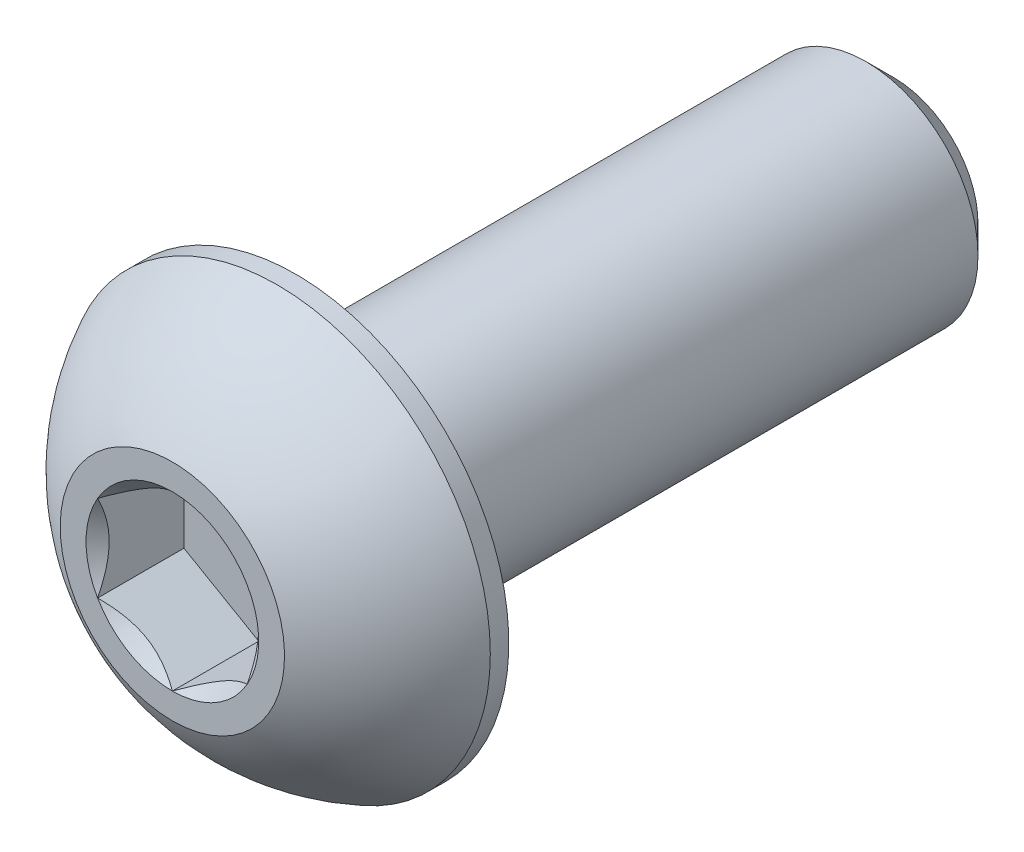
ISO-10303-21;
HEADER;
FILE_DESCRIPTION(('STEP AP214'),'2;1');
FILE_NAME('part.step','',(''),(''),'','','');
FILE_SCHEMA(('AUTOMOTIVE_DESIGN { 1 0 10303 214 1 1 1 1 }'));
ENDSEC;
DATA;
#1=APPLICATION_CONTEXT('core data for automotive mechanical design processes');
#2=APPLICATION_PROTOCOL_DEFINITION('international standard','automotive_design',2000,#1);
#3=PRODUCT_CONTEXT('',#1,'mechanical');
#4=PRODUCT('Part','Part','',(#3));
#5=PRODUCT_RELATED_PRODUCT_CATEGORY('part','',(#4));
#6=PRODUCT_DEFINITION_FORMATION('','',#4);
#7=PRODUCT_DEFINITION_CONTEXT('part definition',#1,'design');
#8=PRODUCT_DEFINITION('design','',#6,#7);
#9=PRODUCT_DEFINITION_SHAPE('','',#8);
#10=(LENGTH_UNIT() NAMED_UNIT(*) SI_UNIT(.MILLI.,.METRE.));
#11=(NAMED_UNIT(*) PLANE_ANGLE_UNIT() SI_UNIT($,.RADIAN.));
#12=(NAMED_UNIT(*) SI_UNIT($,.STERADIAN.) SOLID_ANGLE_UNIT());
#13=UNCERTAINTY_MEASURE_WITH_UNIT(LENGTH_MEASURE(1.E-05),#10,'distance_accuracy_value','');
#14=(GEOMETRIC_REPRESENTATION_CONTEXT(3) GLOBAL_UNCERTAINTY_ASSIGNED_CONTEXT((#13)) GLOBAL_UNIT_ASSIGNED_CONTEXT((#10,
#11,#12)) REPRESENTATION_CONTEXT('',''));
#15=CARTESIAN_POINT('',(0.,0.,0.));
#16=DIRECTION('',(0.,0.,1.));
#17=DIRECTION('',(1.,0.,0.));
#18=AXIS2_PLACEMENT_3D('',#15,#16,#17);
#19=CARTESIAN_POINT('',(0.,-1.15470053837925,-1.155));
#20=DIRECTION('',(0.5,-0.866025403784439,0.));
#21=DIRECTION('',(0.,0.,-1.));
#22=AXIS2_PLACEMENT_3D('',#19,#20,#21);
#23=PLANE('',#22);
#24=DIRECTION('',(0.,0.,1.));
#25=VECTOR('',#24,1.);
#26=CARTESIAN_POINT('',(0.,-1.15470053837925,-1.155));
#27=LINE('',#26,#25);
#28=CARTESIAN_POINT('',(0.,-1.15470053837925,-1.155));
#29=VERTEX_POINT('',#28);
#30=CARTESIAN_POINT('',(0.,-1.15470053837925,0.));
#31=VERTEX_POINT('',#30);
#32=EDGE_CURVE('E11',#29,#31,#27,.T.);
#33=ORIENTED_EDGE('',*,*,#32,.T.);
#34=CARTESIAN_POINT('',(0.,-1.15470053837922,0.));
#35=CARTESIAN_POINT('',(0.5,-0.866025403784439,-0.288675134594791));
#36=CARTESIAN_POINT('',(0.999999999999949,-0.577350269189654,0.));
#37=(BOUNDED_CURVE() B_SPLINE_CURVE(2,(#34,#35,#36),.UNSPECIFIED.,.F.,
.F.) B_SPLINE_CURVE_WITH_KNOTS((3,3),(-0.3218671551163,-0.124274873543865),
.UNSPECIFIED.) CURVE() GEOMETRIC_REPRESENTATION_ITEM() RATIONAL_B_SPLINE_CURVE((1.46410161513778,
1.69059892324148,1.46410161513778)) REPRESENTATION_ITEM(''));
#38=CARTESIAN_POINT('',(1.,-0.577350269189625,0.));
#39=VERTEX_POINT('',#38);
#40=EDGE_CURVE('E115',#31,#39,#37,.T.);
#41=ORIENTED_EDGE('',*,*,#40,.T.);
#42=DIRECTION('',(0.,0.,1.));
#43=VECTOR('',#42,1.);
#44=CARTESIAN_POINT('',(1.,-0.577350269189625,-1.155));
#45=LINE('',#44,#43);
#46=CARTESIAN_POINT('',(1.,-0.577350269189625,-1.155));
#47=VERTEX_POINT('',#46);
#48=EDGE_CURVE('E250',#47,#39,#45,.T.);
#49=ORIENTED_EDGE('',*,*,#48,.F.);
#50=DIRECTION('',(0.866025403784439,0.5,0.));
#51=VECTOR('',#50,1.);
#52=CARTESIAN_POINT('',(0.,-1.15470053837925,-1.155));
#53=LINE('',#52,#51);
#54=EDGE_CURVE('E118',#29,#47,#53,.T.);
#55=ORIENTED_EDGE('',*,*,#54,.F.);
#56=EDGE_LOOP('',(#33,#41,#49,#55));
#57=FACE_BOUND('',#56,.T.);
#58=ADVANCED_FACE('F16',(#57),#23,.F.);
#59=CARTESIAN_POINT('',(-1.,-0.577350269189626,-1.155));
#60=DIRECTION('',(-0.5,-0.866025403784439,0.));
#61=DIRECTION('',(-0.866025403784439,0.5,0.));
#62=AXIS2_PLACEMENT_3D('',#59,#60,#61);
#63=PLANE('',#62);
#64=DIRECTION('',(0.,0.,1.));
#65=VECTOR('',#64,1.);
#66=CARTESIAN_POINT('',(-1.,-0.577350269189626,-1.155));
#67=LINE('',#66,#65);
#68=CARTESIAN_POINT('',(-1.,-0.577350269189626,-1.155));
#69=VERTEX_POINT('',#68);
#70=CARTESIAN_POINT('',(-1.,-0.577350269189625,0.));
#71=VERTEX_POINT('',#70);
#72=EDGE_CURVE('E24',#69,#71,#67,.T.);
#73=ORIENTED_EDGE('',*,*,#72,.T.);
#74=CARTESIAN_POINT('',(-0.999999999999947,-0.577350269189656,0.));
#75=CARTESIAN_POINT('',(-0.499999999999998,-0.866025403784439,-0.28867513459479));
#76=CARTESIAN_POINT('',(0.,-1.15470053837922,0.));
#77=(BOUNDED_CURVE() B_SPLINE_CURVE(2,(#74,#75,#76),.UNSPECIFIED.,.F.,
.F.) B_SPLINE_CURVE_WITH_KNOTS((3,3),(-0.321867155116299,-0.124274873543865),
.UNSPECIFIED.) CURVE() GEOMETRIC_REPRESENTATION_ITEM() RATIONAL_B_SPLINE_CURVE((1.46410161513778,
1.69059892324148,1.46410161513778)) REPRESENTATION_ITEM(''));
#78=EDGE_CURVE('E128',#71,#31,#77,.T.);
#79=ORIENTED_EDGE('',*,*,#78,.T.);
#80=ORIENTED_EDGE('',*,*,#32,.F.);
#81=DIRECTION('',(0.866025403784439,-0.5,0.));
#82=VECTOR('',#81,1.);
#83=CARTESIAN_POINT('',(-1.,-0.577350269189626,-1.155));
#84=LINE('',#83,#82);
#85=EDGE_CURVE('E247',#69,#29,#84,.T.);
#86=ORIENTED_EDGE('',*,*,#85,.F.);
#87=EDGE_LOOP('',(#73,#79,#80,#86));
#88=FACE_BOUND('',#87,.T.);
#89=ADVANCED_FACE('F132',(#88),#63,.F.);
#90=CARTESIAN_POINT('',(-1.,0.577350269189625,-1.155));
#91=DIRECTION('',(-1.,0.,0.));
#92=DIRECTION('',(0.,0.,1.));
#93=AXIS2_PLACEMENT_3D('',#90,#91,#92);
#94=PLANE('',#93);
#95=DIRECTION('',(0.,0.,1.));
#96=VECTOR('',#95,1.);
#97=CARTESIAN_POINT('',(-1.,0.577350269189625,-1.155));
#98=LINE('',#97,#96);
#99=CARTESIAN_POINT('',(-1.,0.577350269189625,-1.155));
#100=VERTEX_POINT('',#99);
#101=CARTESIAN_POINT('',(-1.,0.577350269189625,0.));
#102=VERTEX_POINT('',#101);
#103=EDGE_CURVE('E45',#100,#102,#98,.T.);
#104=ORIENTED_EDGE('',*,*,#103,.T.);
#105=CARTESIAN_POINT('',(-1.,0.577350269189569,0.));
#106=CARTESIAN_POINT('',(-1.,0.,-0.28867513459479));
#107=CARTESIAN_POINT('',(-1.,-0.577350269189568,0.));
#108=(BOUNDED_CURVE() B_SPLINE_CURVE(2,(#105,#106,#107),.UNSPECIFIED.,.F.,
.F.) B_SPLINE_CURVE_WITH_KNOTS((3,3),(-0.3218671551163,-0.124274873543865),
.UNSPECIFIED.) CURVE() GEOMETRIC_REPRESENTATION_ITEM() RATIONAL_B_SPLINE_CURVE((1.46410161513777,
1.69059892324148,1.46410161513778)) REPRESENTATION_ITEM(''));
#109=EDGE_CURVE('E135',#102,#71,#108,.T.);
#110=ORIENTED_EDGE('',*,*,#109,.T.);
#111=ORIENTED_EDGE('',*,*,#72,.F.);
#112=DIRECTION('',(0.,-1.,0.));
#113=VECTOR('',#112,1.);
#114=CARTESIAN_POINT('',(-1.,0.577350269189625,-1.155));
#115=LINE('',#114,#113);
#116=EDGE_CURVE('E243',#100,#69,#115,.T.);
#117=ORIENTED_EDGE('',*,*,#116,.F.);
#118=EDGE_LOOP('',(#104,#110,#111,#117));
#119=FACE_BOUND('',#118,.T.);
#120=ADVANCED_FACE('F336',(#119),#94,.F.);
#121=CARTESIAN_POINT('',(0.,1.15470053837925,-1.155));
#122=DIRECTION('',(-0.5,0.866025403784439,0.));
#123=DIRECTION('',(0.,0.,1.));
#124=AXIS2_PLACEMENT_3D('',#121,#122,#123);
#125=PLANE('',#124);
#126=DIRECTION('',(0.,0.,1.));
#127=VECTOR('',#126,1.);
#128=CARTESIAN_POINT('',(0.,1.15470053837925,-1.155));
#129=LINE('',#128,#127);
#130=CARTESIAN_POINT('',(0.,1.15470053837925,-1.155));
#131=VERTEX_POINT('',#130);
#132=CARTESIAN_POINT('',(0.,1.15470053837925,0.));
#133=VERTEX_POINT('',#132);
#134=EDGE_CURVE('E190',#131,#133,#129,.T.);
#135=ORIENTED_EDGE('',*,*,#134,.T.);
#136=CARTESIAN_POINT('',(0.,1.15470053837922,0.));
#137=CARTESIAN_POINT('',(-0.499999999999999,0.866025403784439,-0.28867513459479));
#138=CARTESIAN_POINT('',(-0.999999999999948,0.577350269189655,0.));
#139=(BOUNDED_CURVE() B_SPLINE_CURVE(2,(#136,#137,#138),.UNSPECIFIED.,.F.,
.F.) B_SPLINE_CURVE_WITH_KNOTS((3,3),(-0.3218671551163,-0.124274873543865),
.UNSPECIFIED.) CURVE() GEOMETRIC_REPRESENTATION_ITEM() RATIONAL_B_SPLINE_CURVE((1.46410161513778,
1.69059892324148,1.46410161513778)) REPRESENTATION_ITEM(''));
#140=EDGE_CURVE('E201',#133,#102,#139,.T.);
#141=ORIENTED_EDGE('',*,*,#140,.T.);
#142=ORIENTED_EDGE('',*,*,#103,.F.);
#143=DIRECTION('',(-0.866025403784439,-0.5,0.));
#144=VECTOR('',#143,1.);
#145=CARTESIAN_POINT('',(0.,1.15470053837925,-1.155));
#146=LINE('',#145,#144);
#147=EDGE_CURVE('E239',#131,#100,#146,.T.);
#148=ORIENTED_EDGE('',*,*,#147,.F.);
#149=EDGE_LOOP('',(#135,#141,#142,#148));
#150=FACE_BOUND('',#149,.T.);
#151=ADVANCED_FACE('F258',(#150),#125,.F.);
#152=CARTESIAN_POINT('',(1.,0.577350269189626,-1.155));
#153=DIRECTION('',(0.5,0.866025403784439,0.));
#154=DIRECTION('',(0.,0.,-1.));
#155=AXIS2_PLACEMENT_3D('',#152,#153,#154);
#156=PLANE('',#155);
#157=DIRECTION('',(0.,0.,1.));
#158=VECTOR('',#157,1.);
#159=CARTESIAN_POINT('',(1.,0.577350269189626,-1.155));
#160=LINE('',#159,#158);
#161=CARTESIAN_POINT('',(1.,0.577350269189626,-1.155));
#162=VERTEX_POINT('',#161);
#163=CARTESIAN_POINT('',(1.,0.577350269189625,0.));
#164=VERTEX_POINT('',#163);
#165=EDGE_CURVE('E253',#162,#164,#160,.T.);
#166=ORIENTED_EDGE('',*,*,#165,.T.);
#167=CARTESIAN_POINT('',(0.999999999999951,0.577350269189654,0.));
#168=CARTESIAN_POINT('',(0.5,0.866025403784439,-0.28867513459479));
#169=CARTESIAN_POINT('',(0.,1.15470053837922,0.));
#170=(BOUNDED_CURVE() B_SPLINE_CURVE(2,(#167,#168,#169),.UNSPECIFIED.,.F.,
.F.) B_SPLINE_CURVE_WITH_KNOTS((3,3),(-0.3218671551163,-0.124274873543865),
.UNSPECIFIED.) CURVE() GEOMETRIC_REPRESENTATION_ITEM() RATIONAL_B_SPLINE_CURVE((1.46410161513778,
1.69059892324148,1.46410161513778)) REPRESENTATION_ITEM(''));
#171=EDGE_CURVE('E144',#164,#133,#170,.T.);
#172=ORIENTED_EDGE('',*,*,#171,.T.);
#173=ORIENTED_EDGE('',*,*,#134,.F.);
#174=DIRECTION('',(-0.866025403784439,0.5,0.));
#175=VECTOR('',#174,1.);
#176=CARTESIAN_POINT('',(1.,0.577350269189626,-1.155));
#177=LINE('',#176,#175);
#178=EDGE_CURVE('E235',#162,#131,#177,.T.);
#179=ORIENTED_EDGE('',*,*,#178,.F.);
#180=EDGE_LOOP('',(#166,#172,#173,#179));
#181=FACE_BOUND('',#180,.T.);
#182=ADVANCED_FACE('F266',(#181),#156,.F.);
#183=CARTESIAN_POINT('',(1.,-0.577350269189625,-1.155));
#184=DIRECTION('',(1.,0.,0.));
#185=DIRECTION('',(0.,1.,0.));
#186=AXIS2_PLACEMENT_3D('',#183,#184,#185);
#187=PLANE('',#186);
#188=ORIENTED_EDGE('',*,*,#48,.T.);
#189=CARTESIAN_POINT('',(1.,-0.577350269189567,0.));
#190=CARTESIAN_POINT('',(1.,0.,-0.288675134594789));
#191=CARTESIAN_POINT('',(1.,0.577350269189567,0.));
#192=(BOUNDED_CURVE() B_SPLINE_CURVE(2,(#189,#190,#191),.UNSPECIFIED.,.F.,
.F.) B_SPLINE_CURVE_WITH_KNOTS((3,3),(-0.321867155116299,-0.124274873543865),
.UNSPECIFIED.) CURVE() GEOMETRIC_REPRESENTATION_ITEM() RATIONAL_B_SPLINE_CURVE((1.46410161513778,
1.69059892324148,1.46410161513778)) REPRESENTATION_ITEM(''));
#193=EDGE_CURVE('E166',#39,#164,#192,.T.);
#194=ORIENTED_EDGE('',*,*,#193,.T.);
#195=ORIENTED_EDGE('',*,*,#165,.F.);
#196=DIRECTION('',(0.,1.,0.));
#197=VECTOR('',#196,1.);
#198=CARTESIAN_POINT('',(1.,-0.577350269189625,-1.155));
#199=LINE('',#198,#197);
#200=EDGE_CURVE('E231',#47,#162,#199,.T.);
#201=ORIENTED_EDGE('',*,*,#200,.F.);
#202=EDGE_LOOP('',(#188,#194,#195,#201));
#203=FACE_BOUND('',#202,.T.);
#204=ADVANCED_FACE('F352',(#203),#187,.F.);
#205=CARTESIAN_POINT('',(1.,-0.577350269189625,-1.155));
#206=DIRECTION('',(0.,0.,1.));
#207=DIRECTION('',(1.,0.,0.));
#208=AXIS2_PLACEMENT_3D('',#205,#206,#207);
#209=PLANE('',#208);
#210=ORIENTED_EDGE('',*,*,#54,.T.);
#211=ORIENTED_EDGE('',*,*,#200,.T.);
#212=ORIENTED_EDGE('',*,*,#178,.T.);
#213=ORIENTED_EDGE('',*,*,#147,.T.);
#214=ORIENTED_EDGE('',*,*,#116,.T.);
#215=ORIENTED_EDGE('',*,*,#85,.T.);
#216=EDGE_LOOP('',(#210,#211,#212,#213,#214,#215));
#217=FACE_BOUND('',#216,.T.);
#218=ADVANCED_FACE('F346',(#217),#209,.T.);
#219=CARTESIAN_POINT('',(0.,0.,0.));
#220=DIRECTION('',(0.,0.,1.));
#221=DIRECTION('',(1.,0.,0.));
#222=AXIS2_PLACEMENT_3D('',#219,#220,#221);
#223=CONICAL_SURFACE('',#222,1.15470053837925,0.78539816339745);
#224=CARTESIAN_POINT('',(0.,0.,0.));
#225=DIRECTION('',(0.,0.,1.));
#226=DIRECTION('',(1.,0.,0.));
#227=AXIS2_PLACEMENT_3D('',#224,#225,#226);
#228=CIRCLE('',#227,1.15470053837925);
#229=EDGE_CURVE('E125',#31,#39,#228,.T.);
#230=ORIENTED_EDGE('',*,*,#229,.T.);
#231=ORIENTED_EDGE('',*,*,#40,.F.);
#232=EDGE_LOOP('',(#230,#231));
#233=FACE_BOUND('',#232,.T.);
#234=ADVANCED_FACE('F123',(#233),#223,.F.);
#235=CARTESIAN_POINT('',(0.,0.,0.));
#236=DIRECTION('',(0.,0.,1.));
#237=DIRECTION('',(1.,0.,0.));
#238=AXIS2_PLACEMENT_3D('',#235,#236,#237);
#239=CONICAL_SURFACE('',#238,1.15470053837925,0.78539816339745);
#240=CARTESIAN_POINT('',(0.,0.,0.));
#241=DIRECTION('',(0.,0.,1.));
#242=DIRECTION('',(1.,0.,0.));
#243=AXIS2_PLACEMENT_3D('',#240,#241,#242);
#244=CIRCLE('',#243,1.15470053837925);
#245=EDGE_CURVE('E138',#71,#31,#244,.T.);
#246=ORIENTED_EDGE('',*,*,#245,.T.);
#247=ORIENTED_EDGE('',*,*,#78,.F.);
#248=EDGE_LOOP('',(#246,#247));
#249=FACE_BOUND('',#248,.T.);
#250=ADVANCED_FACE('F139',(#249),#239,.F.);
#251=CARTESIAN_POINT('',(0.,0.,0.));
#252=DIRECTION('',(0.,0.,1.));
#253=DIRECTION('',(-1.,0.,0.));
#254=AXIS2_PLACEMENT_3D('',#251,#252,#253);
#255=CONICAL_SURFACE('',#254,1.15470053837925,0.78539816339745);
#256=CARTESIAN_POINT('',(0.,0.,0.));
#257=DIRECTION('',(0.,0.,1.));
#258=DIRECTION('',(1.,0.,0.));
#259=AXIS2_PLACEMENT_3D('',#256,#257,#258);
#260=CIRCLE('',#259,1.15470053837925);
#261=EDGE_CURVE('E182',#102,#71,#260,.T.);
#262=ORIENTED_EDGE('',*,*,#261,.T.);
#263=ORIENTED_EDGE('',*,*,#109,.F.);
#264=EDGE_LOOP('',(#262,#263));
#265=FACE_BOUND('',#264,.T.);
#266=ADVANCED_FACE('F349',(#265),#255,.F.);
#267=CARTESIAN_POINT('',(0.,0.,0.));
#268=DIRECTION('',(0.,0.,1.));
#269=DIRECTION('',(1.,0.,0.));
#270=AXIS2_PLACEMENT_3D('',#267,#268,#269);
#271=CONICAL_SURFACE('',#270,1.15470053837925,0.78539816339745);
#272=CARTESIAN_POINT('',(0.,0.,0.));
#273=DIRECTION('',(0.,0.,1.));
#274=DIRECTION('',(1.,0.,0.));
#275=AXIS2_PLACEMENT_3D('',#272,#273,#274);
#276=CIRCLE('',#275,1.15470053837925);
#277=EDGE_CURVE('E160',#133,#102,#276,.T.);
#278=ORIENTED_EDGE('',*,*,#277,.T.);
#279=ORIENTED_EDGE('',*,*,#140,.F.);
#280=EDGE_LOOP('',(#278,#279));
#281=FACE_BOUND('',#280,.T.);
#282=ADVANCED_FACE('F263',(#281),#271,.F.);
#283=CARTESIAN_POINT('',(0.,0.,0.));
#284=DIRECTION('',(0.,0.,1.));
#285=DIRECTION('',(1.,0.,0.));
#286=AXIS2_PLACEMENT_3D('',#283,#284,#285);
#287=CONICAL_SURFACE('',#286,1.15470053837925,0.78539816339745);
#288=CARTESIAN_POINT('',(0.,0.,0.));
#289=DIRECTION('',(0.,0.,1.));
#290=DIRECTION('',(1.,0.,0.));
#291=AXIS2_PLACEMENT_3D('',#288,#289,#290);
#292=CIRCLE('',#291,1.15470053837925);
#293=EDGE_CURVE('E153',#164,#133,#292,.T.);
#294=ORIENTED_EDGE('',*,*,#293,.T.);
#295=ORIENTED_EDGE('',*,*,#171,.F.);
#296=EDGE_LOOP('',(#294,#295));
#297=FACE_BOUND('',#296,.T.);
#298=ADVANCED_FACE('F268',(#297),#287,.F.);
#299=CARTESIAN_POINT('',(0.,-2.85,-1.65));
#300=DIRECTION('',(0.,0.,1.));
#301=DIRECTION('',(1.,0.,0.));
#302=AXIS2_PLACEMENT_3D('',#299,#300,#301);
#303=PLANE('',#302);
#304=CARTESIAN_POINT('',(-6.80199394126972E-12,-2.81755591080568E-10,-1.65));
#305=DIRECTION('',(0.,0.,1.));
#306=DIRECTION('',(0.,1.,0.));
#307=AXIS2_PLACEMENT_3D('',#304,#305,#306);
#308=CIRCLE('',#307,1.5);
#309=CARTESIAN_POINT('',(-6.80208907479055E-12,-1.50000000028176,-1.65));
#310=VERTEX_POINT('',#309);
#311=EDGE_CURVE('E276',#310,#310,#308,.T.);
#312=ORIENTED_EDGE('',*,*,#311,.T.);
#313=EDGE_LOOP('',(#312));
#314=FACE_BOUND('',#313,.T.);
#315=CARTESIAN_POINT('',(0.,0.,-1.65));
#316=DIRECTION('',(0.,0.,1.));
#317=DIRECTION('',(1.,0.,0.));
#318=AXIS2_PLACEMENT_3D('',#315,#316,#317);
#319=CIRCLE('',#318,2.85);
#320=CARTESIAN_POINT('',(-2.85,0.,-1.65));
#321=VERTEX_POINT('',#320);
#322=EDGE_CURVE('E183',#321,#321,#319,.T.);
#323=ORIENTED_EDGE('',*,*,#322,.F.);
#324=EDGE_LOOP('',(#323));
#325=FACE_BOUND('',#324,.T.);
#326=ADVANCED_FACE('F305',(#314,#325),#303,.F.);
#327=CARTESIAN_POINT('',(0.,-1.5,0.));
#328=DIRECTION('',(0.,0.,-1.));
#329=DIRECTION('',(0.,-1.,0.));
#330=AXIS2_PLACEMENT_3D('',#327,#328,#329);
#331=PLANE('',#330);
#332=ORIENTED_EDGE('',*,*,#261,.F.);
#333=ORIENTED_EDGE('',*,*,#277,.F.);
#334=ORIENTED_EDGE('',*,*,#293,.F.);
#335=CARTESIAN_POINT('',(0.,0.,0.));
#336=DIRECTION('',(0.,0.,1.));
#337=DIRECTION('',(1.,0.,0.));
#338=AXIS2_PLACEMENT_3D('',#335,#336,#337);
#339=CIRCLE('',#338,1.15470053837925);
#340=EDGE_CURVE('E150',#39,#164,#339,.T.);
#341=ORIENTED_EDGE('',*,*,#340,.F.);
#342=ORIENTED_EDGE('',*,*,#229,.F.);
#343=ORIENTED_EDGE('',*,*,#245,.F.);
#344=EDGE_LOOP('',(#332,#333,#334,#341,#342,#343));
#345=FACE_BOUND('',#344,.T.);
#346=CARTESIAN_POINT('',(0.,0.,0.));
#347=DIRECTION('',(0.,0.,1.));
#348=DIRECTION('',(1.,0.,0.));
#349=AXIS2_PLACEMENT_3D('',#346,#347,#348);
#350=CIRCLE('',#349,1.5);
#351=CARTESIAN_POINT('',(0.,-1.5,0.));
#352=VERTEX_POINT('',#351);
#353=EDGE_CURVE('E179',#352,#352,#350,.T.);
#354=ORIENTED_EDGE('',*,*,#353,.T.);
#355=EDGE_LOOP('',(#354));
#356=FACE_BOUND('',#355,.T.);
#357=ADVANCED_FACE('F146',(#345,#356),#331,.F.);
#358=CARTESIAN_POINT('',(0.,-1.5,-9.65));
#359=DIRECTION('',(0.,0.,-1.));
#360=DIRECTION('',(0.,-1.,0.));
#361=AXIS2_PLACEMENT_3D('',#358,#359,#360);
#362=PLANE('',#361);
#363=CARTESIAN_POINT('',(0.,0.,-9.65));
#364=DIRECTION('',(0.,0.,-1.));
#365=DIRECTION('',(0.,1.,0.));
#366=AXIS2_PLACEMENT_3D('',#363,#364,#365);
#367=CIRCLE('',#366,1.125);
#368=CARTESIAN_POINT('',(0.,1.125,-9.65));
#369=VERTEX_POINT('',#368);
#370=EDGE_CURVE('E164',#369,#369,#367,.T.);
#371=ORIENTED_EDGE('',*,*,#370,.T.);
#372=EDGE_LOOP('',(#371));
#373=FACE_BOUND('',#372,.T.);
#374=ADVANCED_FACE('F297',(#373),#362,.T.);
#375=CARTESIAN_POINT('',(0.,0.,-2.79483288770053));
#376=DIRECTION('',(1.,0.,0.));
#377=DIRECTION('',(0.,-1.,0.));
#378=AXIS2_PLACEMENT_3D('',#375,#376,#377);
#379=SPHERICAL_SURFACE('',#378,3.17192226735973);
#380=CARTESIAN_POINT('',(0.,0.,-2.79483288770053));
#381=DIRECTION('',(0.,0.,1.));
#382=DIRECTION('',(1.,0.,0.));
#383=AXIS2_PLACEMENT_3D('',#380,#381,#382);
#384=SPHERICAL_SURFACE('',#383,3.17192226735973);
#385=ORIENTED_EDGE('',*,*,#353,.F.);
#386=EDGE_LOOP('',(#385));
#387=FACE_BOUND('',#386,.T.);
#388=CARTESIAN_POINT('',(0.,0.,-1.4025));
#389=DIRECTION('',(0.,0.,1.));
#390=DIRECTION('',(1.,0.,0.));
#391=AXIS2_PLACEMENT_3D('',#388,#389,#390);
#392=CIRCLE('',#391,2.85);
#393=CARTESIAN_POINT('',(-2.85,0.,-1.4025));
#394=VERTEX_POINT('',#393);
#395=EDGE_CURVE('E176',#394,#394,#392,.T.);
#396=ORIENTED_EDGE('',*,*,#395,.T.);
#397=EDGE_LOOP('',(#396));
#398=FACE_BOUND('',#397,.T.);
#399=ADVANCED_FACE('F317',(#387,#398),#384,.T.);
#400=CARTESIAN_POINT('',(0.,0.,0.));
#401=DIRECTION('',(0.,0.,1.));
#402=DIRECTION('',(1.,0.,0.));
#403=AXIS2_PLACEMENT_3D('',#400,#401,#402);
#404=CYLINDRICAL_SURFACE('',#403,2.85);
#405=ORIENTED_EDGE('',*,*,#395,.F.);
#406=DIRECTION('',(0.,0.,-1.));
#407=VECTOR('',#406,1.);
#408=CARTESIAN_POINT('',(-2.85,0.,0.));
#409=LINE('',#408,#407);
#410=EDGE_CURVE('E186',#394,#321,#409,.T.);
#411=ORIENTED_EDGE('',*,*,#410,.T.);
#412=ORIENTED_EDGE('',*,*,#322,.T.);
#413=ORIENTED_EDGE('',*,*,#410,.F.);
#414=EDGE_LOOP('',(#405,#411,#412,#413));
#415=FACE_BOUND('',#414,.T.);
#416=ADVANCED_FACE('F315',(#415),#404,.T.);
#417=CARTESIAN_POINT('',(0.,0.,0.));
#418=DIRECTION('',(0.,0.,1.));
#419=DIRECTION('',(1.,0.,0.));
#420=AXIS2_PLACEMENT_3D('',#417,#418,#419);
#421=CONICAL_SURFACE('',#420,1.15470053837925,0.78539816339745);
#422=ORIENTED_EDGE('',*,*,#193,.F.);
#423=ORIENTED_EDGE('',*,*,#340,.T.);
#424=EDGE_LOOP('',(#422,#423));
#425=FACE_BOUND('',#424,.T.);
#426=ADVANCED_FACE('F326',(#425),#421,.F.);
#427=CARTESIAN_POINT('',(0.,0.,-9.65));
#428=DIRECTION('',(0.,0.,1.));
#429=DIRECTION('',(0.,-1.,0.));
#430=AXIS2_PLACEMENT_3D('',#427,#428,#429);
#431=CONICAL_SURFACE('',#430,1.125,0.785398163397444);
#432=CARTESIAN_POINT('',(-4.91334425790858E-13,-2.81755591080568E-10,-9.275));
#433=DIRECTION('',(8.27627477439851E-13,0.,-1.));
#434=DIRECTION('',(0.,1.,0.));
#435=AXIS2_PLACEMENT_3D('',#432,#433,#434);
#436=CIRCLE('',#435,1.5);
#437=CARTESIAN_POINT('',(-4.91062165271942E-13,-1.50000000028176,-9.275));
#438=VERTEX_POINT('',#437);
#439=CARTESIAN_POINT('',(0.,1.50000000014107,-9.27499999985893));
#440=VERTEX_POINT('',#439);
#441=EDGE_CURVE('E283',#438,#440,#436,.T.);
#442=ORIENTED_EDGE('',*,*,#441,.T.);
#443=DIRECTION('',(0.,-0.707106781186545,-0.70710678118655));
#444=VECTOR('',#443,1.);
#445=CARTESIAN_POINT('',(0.,1.125,-9.65));
#446=LINE('',#445,#444);
#447=EDGE_CURVE('E287',#440,#369,#446,.T.);
#448=ORIENTED_EDGE('',*,*,#447,.T.);
#449=ORIENTED_EDGE('',*,*,#370,.F.);
#450=ORIENTED_EDGE('',*,*,#447,.F.);
#451=CARTESIAN_POINT('',(-4.91334425790858E-13,-2.81755591080568E-10,-9.275));
#452=DIRECTION('',(8.27627477439851E-13,0.,-1.));
#453=DIRECTION('',(0.,1.,0.));
#454=AXIS2_PLACEMENT_3D('',#451,#452,#453);
#455=CIRCLE('',#454,1.5);
#456=EDGE_CURVE('E280',#440,#438,#455,.T.);
#457=ORIENTED_EDGE('',*,*,#456,.T.);
#458=EDGE_LOOP('',(#442,#448,#449,#450,#457));
#459=FACE_BOUND('',#458,.T.);
#460=ADVANCED_FACE('F298',(#459),#431,.T.);
#461=CARTESIAN_POINT('',(0.,-2.81755591080568E-10,-9.86875));
#462=DIRECTION('',(-8.27627477439851E-13,0.,1.));
#463=DIRECTION('',(0.,1.,0.));
#464=AXIS2_PLACEMENT_3D('',#461,#462,#463);
#465=CYLINDRICAL_SURFACE('',#464,1.5);
#466=ORIENTED_EDGE('',*,*,#311,.F.);
#467=DIRECTION('',(8.27627477439851E-13,0.,-1.));
#468=VECTOR('',#467,1.);
#469=CARTESIAN_POINT('',(0.,-1.50000000028176,-9.86875));
#470=LINE('',#469,#468);
#471=EDGE_CURVE('E277',#310,#438,#470,.T.);
#472=ORIENTED_EDGE('',*,*,#471,.T.);
#473=ORIENTED_EDGE('',*,*,#456,.F.);
#474=ORIENTED_EDGE('',*,*,#441,.F.);
#475=ORIENTED_EDGE('',*,*,#471,.F.);
#476=EDGE_LOOP('',(#466,#472,#473,#474,#475));
#477=FACE_BOUND('',#476,.T.);
#478=ADVANCED_FACE('F302',(#477),#465,.T.);
#479=CLOSED_SHELL('',(#58,#89,#120,#151,#182,#204,#218,#234,#250,#266,#282,#298,#326,#357,#374,
#399,#416,#426,#460,#478));
#480=MANIFOLD_SOLID_BREP('B1',#479);
#481=ADVANCED_BREP_SHAPE_REPRESENTATION('',(#18,#480),#14);
#482=SHAPE_DEFINITION_REPRESENTATION(#9,#481);
ENDSEC;
END-ISO-10303-21;
